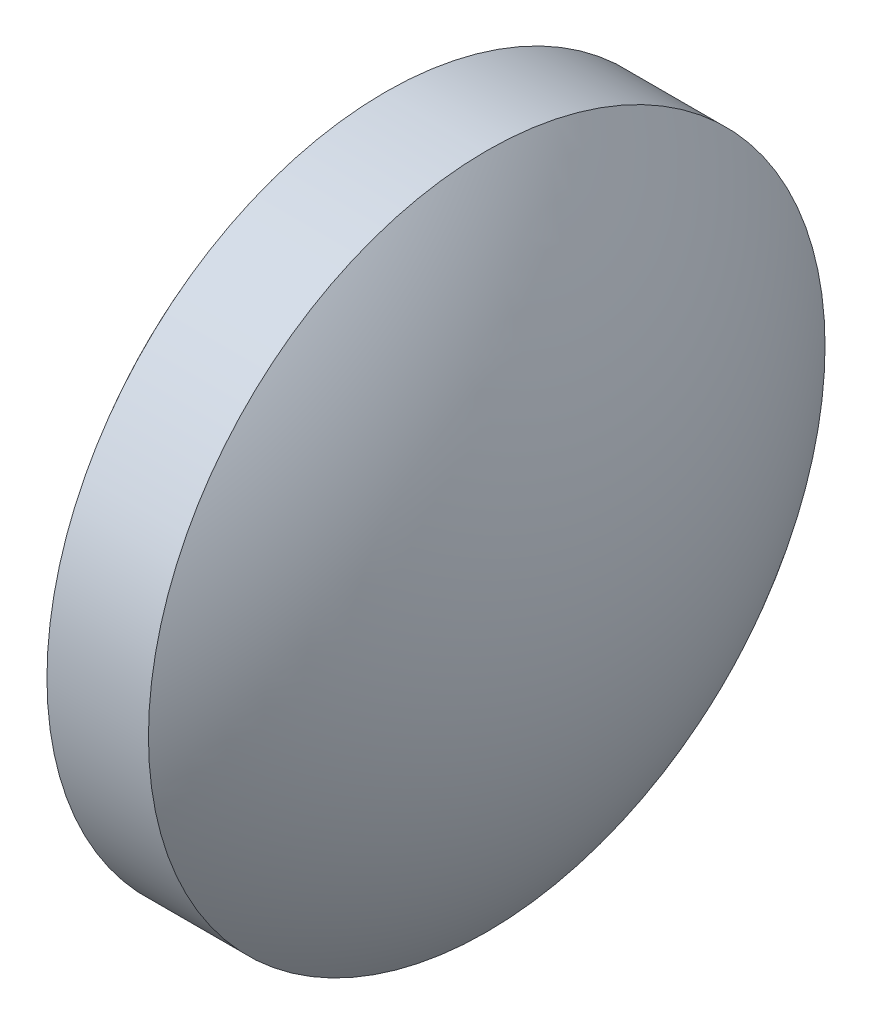
ISO-10303-21;
HEADER;
FILE_DESCRIPTION(('STEP AP214'),'2;1');
FILE_NAME('part.step','',(''),(''),'','','');
FILE_SCHEMA(('AUTOMOTIVE_DESIGN { 1 0 10303 214 1 1 1 1 }'));
ENDSEC;
DATA;
#1=APPLICATION_CONTEXT('core data for automotive mechanical design processes');
#2=APPLICATION_PROTOCOL_DEFINITION('international standard','automotive_design',2000,#1);
#3=PRODUCT_CONTEXT('',#1,'mechanical');
#4=PRODUCT('Part','Part','',(#3));
#5=PRODUCT_RELATED_PRODUCT_CATEGORY('part','',(#4));
#6=PRODUCT_DEFINITION_FORMATION('','',#4);
#7=PRODUCT_DEFINITION_CONTEXT('part definition',#1,'design');
#8=PRODUCT_DEFINITION('design','',#6,#7);
#9=PRODUCT_DEFINITION_SHAPE('','',#8);
#10=(LENGTH_UNIT() NAMED_UNIT(*) SI_UNIT(.MILLI.,.METRE.));
#11=(NAMED_UNIT(*) PLANE_ANGLE_UNIT() SI_UNIT($,.RADIAN.));
#12=(NAMED_UNIT(*) SI_UNIT($,.STERADIAN.) SOLID_ANGLE_UNIT());
#13=UNCERTAINTY_MEASURE_WITH_UNIT(LENGTH_MEASURE(1.E-05),#10,'distance_accuracy_value','');
#14=(GEOMETRIC_REPRESENTATION_CONTEXT(3) GLOBAL_UNCERTAINTY_ASSIGNED_CONTEXT((#13)) GLOBAL_UNIT_ASSIGNED_CONTEXT((#10,
#11,#12)) REPRESENTATION_CONTEXT('',''));
#15=CARTESIAN_POINT('',(0.,0.,0.));
#16=DIRECTION('',(0.,0.,1.));
#17=DIRECTION('',(1.,0.,0.));
#18=AXIS2_PLACEMENT_3D('',#15,#16,#17);
#19=CARTESIAN_POINT('',(39.9636664739101,19.1402019776318,0.));
#20=DIRECTION('',(-1.,0.,0.));
#21=DIRECTION('',(0.,1.,0.));
#22=AXIS2_PLACEMENT_3D('',#19,#20,#21);
#23=SPHERICAL_SURFACE('',#22,8.34000750750751);
#24=CARTESIAN_POINT('',(33.2886589664026,19.1402019776318,0.));
#25=DIRECTION('',(-1.,0.,0.));
#26=DIRECTION('',(0.,0.,1.));
#27=AXIS2_PLACEMENT_3D('',#24,#25,#26);
#28=CIRCLE('',#27,5.);
#29=CARTESIAN_POINT('',(33.2886589664026,19.1402019776318,5.));
#30=VERTEX_POINT('',#29);
#31=EDGE_CURVE('E46',#30,#30,#28,.T.);
#32=ORIENTED_EDGE('',*,*,#31,.T.);
#33=EDGE_LOOP('',(#32));
#34=FACE_BOUND('',#33,.T.);
#35=ADVANCED_FACE('F39',(#34),#23,.T.);
#36=CARTESIAN_POINT('',(28.1136514588951,19.1402019776318,0.));
#37=DIRECTION('',(-1.,0.,0.));
#38=DIRECTION('',(0.,1.,0.));
#39=AXIS2_PLACEMENT_3D('',#36,#37,#38);
#40=SPHERICAL_SURFACE('',#39,8.34000750750751);
#41=CARTESIAN_POINT('',(34.7886589664026,19.1402019776318,0.));
#42=DIRECTION('',(-1.,0.,0.));
#43=DIRECTION('',(0.,0.,1.));
#44=AXIS2_PLACEMENT_3D('',#41,#42,#43);
#45=CIRCLE('',#44,5.);
#46=CARTESIAN_POINT('',(34.7886589664026,19.1402019776318,5.));
#47=VERTEX_POINT('',#46);
#48=EDGE_CURVE('E10',#47,#47,#45,.T.);
#49=ORIENTED_EDGE('',*,*,#48,.F.);
#50=EDGE_LOOP('',(#49));
#51=FACE_BOUND('',#50,.T.);
#52=ADVANCED_FACE('F56',(#51),#40,.T.);
#53=CARTESIAN_POINT('',(31.2225989570225,19.1402019776318,0.));
#54=DIRECTION('',(-1.,0.,0.));
#55=DIRECTION('',(0.,0.,1.));
#56=AXIS2_PLACEMENT_3D('',#53,#54,#55);
#57=CYLINDRICAL_SURFACE('',#56,5.);
#58=ORIENTED_EDGE('',*,*,#48,.T.);
#59=EDGE_LOOP('',(#58));
#60=FACE_BOUND('',#59,.T.);
#61=ORIENTED_EDGE('',*,*,#31,.F.);
#62=EDGE_LOOP('',(#61));
#63=FACE_BOUND('',#62,.T.);
#64=ADVANCED_FACE('F54',(#60,#63),#57,.T.);
#65=CLOSED_SHELL('',(#35,#52,#64));
#66=MANIFOLD_SOLID_BREP('B2',#65);
#67=ADVANCED_BREP_SHAPE_REPRESENTATION('',(#18,#66),#14);
#68=SHAPE_DEFINITION_REPRESENTATION(#9,#67);
ENDSEC;
END-ISO-10303-21;
